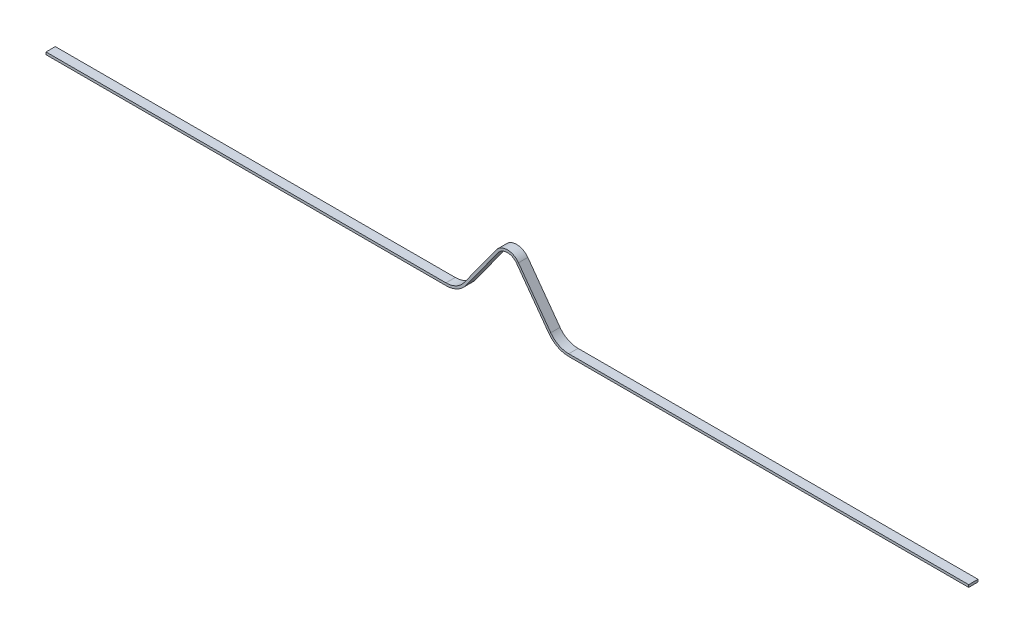
ISO-10303-21;
HEADER;
FILE_DESCRIPTION(('STEP AP214'),'2;1');
FILE_NAME('part.step','',(''),(''),'','','');
FILE_SCHEMA(('AUTOMOTIVE_DESIGN { 1 0 10303 214 1 1 1 1 }'));
ENDSEC;
DATA;
#1=APPLICATION_CONTEXT('core data for automotive mechanical design processes');
#2=APPLICATION_PROTOCOL_DEFINITION('international standard','automotive_design',2000,#1);
#3=PRODUCT_CONTEXT('',#1,'mechanical');
#4=PRODUCT('Part','Part','',(#3));
#5=PRODUCT_RELATED_PRODUCT_CATEGORY('part','',(#4));
#6=PRODUCT_DEFINITION_FORMATION('','',#4);
#7=PRODUCT_DEFINITION_CONTEXT('part definition',#1,'design');
#8=PRODUCT_DEFINITION('design','',#6,#7);
#9=PRODUCT_DEFINITION_SHAPE('','',#8);
#10=(LENGTH_UNIT() NAMED_UNIT(*) SI_UNIT(.MILLI.,.METRE.));
#11=(NAMED_UNIT(*) PLANE_ANGLE_UNIT() SI_UNIT($,.RADIAN.));
#12=(NAMED_UNIT(*) SI_UNIT($,.STERADIAN.) SOLID_ANGLE_UNIT());
#13=UNCERTAINTY_MEASURE_WITH_UNIT(LENGTH_MEASURE(1.E-05),#10,'distance_accuracy_value','');
#14=(GEOMETRIC_REPRESENTATION_CONTEXT(3) GLOBAL_UNCERTAINTY_ASSIGNED_CONTEXT((#13)) GLOBAL_UNIT_ASSIGNED_CONTEXT((#10,
#11,#12)) REPRESENTATION_CONTEXT('',''));
#15=CARTESIAN_POINT('',(0.,0.,0.));
#16=DIRECTION('',(0.,0.,1.));
#17=DIRECTION('',(1.,0.,0.));
#18=AXIS2_PLACEMENT_3D('',#15,#16,#17);
#19=CARTESIAN_POINT('',(248.,-25.7999999999999,2.5));
#20=DIRECTION('',(0.,1.,0.));
#21=DIRECTION('',(-1.,0.,0.));
#22=AXIS2_PLACEMENT_3D('',#19,#20,#21);
#23=PLANE('',#22);
#24=DIRECTION('',(1.,0.,0.));
#25=VECTOR('',#24,1.);
#26=CARTESIAN_POINT('',(248.,-25.7999999999999,-2.5));
#27=LINE('',#26,#25);
#28=CARTESIAN_POINT('',(33.,-25.8,-2.5));
#29=VERTEX_POINT('',#28);
#30=CARTESIAN_POINT('',(248.,-25.7999999999999,-2.5));
#31=VERTEX_POINT('',#30);
#32=EDGE_CURVE('E175',#29,#31,#27,.T.);
#33=ORIENTED_EDGE('',*,*,#32,.T.);
#34=DIRECTION('',(0.,0.,-1.));
#35=VECTOR('',#34,1.);
#36=CARTESIAN_POINT('',(248.,-25.7999999999999,2.5));
#37=LINE('',#36,#35);
#38=CARTESIAN_POINT('',(248.,-25.7999999999999,2.5));
#39=VERTEX_POINT('',#38);
#40=EDGE_CURVE('E11',#39,#31,#37,.T.);
#41=ORIENTED_EDGE('',*,*,#40,.F.);
#42=DIRECTION('',(1.,0.,0.));
#43=VECTOR('',#42,1.);
#44=CARTESIAN_POINT('',(248.,-25.7999999999999,2.5));
#45=LINE('',#44,#43);
#46=CARTESIAN_POINT('',(33.,-25.8,2.5));
#47=VERTEX_POINT('',#46);
#48=EDGE_CURVE('E112',#47,#39,#45,.T.);
#49=ORIENTED_EDGE('',*,*,#48,.F.);
#50=DIRECTION('',(0.,0.,-1.));
#51=VECTOR('',#50,1.);
#52=CARTESIAN_POINT('',(33.,-25.8,2.5));
#53=LINE('',#52,#51);
#54=EDGE_CURVE('E171',#47,#29,#53,.T.);
#55=ORIENTED_EDGE('',*,*,#54,.T.);
#56=EDGE_LOOP('',(#33,#41,#49,#55));
#57=FACE_BOUND('',#56,.T.);
#58=ADVANCED_FACE('F32',(#57),#23,.F.);
#59=CARTESIAN_POINT('',(248.,-24.4999999999999,2.5));
#60=DIRECTION('',(1.,0.,0.));
#61=DIRECTION('',(0.,0.,-1.));
#62=AXIS2_PLACEMENT_3D('',#59,#60,#61);
#63=PLANE('',#62);
#64=DIRECTION('',(0.,-1.,0.));
#65=VECTOR('',#64,1.);
#66=CARTESIAN_POINT('',(248.,-24.4999999999999,-2.5));
#67=LINE('',#66,#65);
#68=CARTESIAN_POINT('',(248.,-24.4999999999999,-2.5));
#69=VERTEX_POINT('',#68);
#70=EDGE_CURVE('E178',#69,#31,#67,.T.);
#71=ORIENTED_EDGE('',*,*,#70,.F.);
#72=DIRECTION('',(0.,0.,-1.));
#73=VECTOR('',#72,1.);
#74=CARTESIAN_POINT('',(248.,-24.4999999999999,2.5));
#75=LINE('',#74,#73);
#76=CARTESIAN_POINT('',(248.,-24.4999999999999,2.5));
#77=VERTEX_POINT('',#76);
#78=EDGE_CURVE('E40',#77,#69,#75,.T.);
#79=ORIENTED_EDGE('',*,*,#78,.F.);
#80=DIRECTION('',(0.,-1.,0.));
#81=VECTOR('',#80,1.);
#82=CARTESIAN_POINT('',(248.,-24.4999999999999,2.5));
#83=LINE('',#82,#81);
#84=EDGE_CURVE('E260',#77,#39,#83,.T.);
#85=ORIENTED_EDGE('',*,*,#84,.T.);
#86=ORIENTED_EDGE('',*,*,#40,.T.);
#87=EDGE_LOOP('',(#71,#79,#85,#86));
#88=FACE_BOUND('',#87,.T.);
#89=ADVANCED_FACE('F247',(#88),#63,.T.);
#90=CARTESIAN_POINT('',(248.,-24.4999999999999,2.5));
#91=DIRECTION('',(0.,1.,0.));
#92=DIRECTION('',(-1.,0.,0.));
#93=AXIS2_PLACEMENT_3D('',#90,#91,#92);
#94=PLANE('',#93);
#95=DIRECTION('',(1.,0.,0.));
#96=VECTOR('',#95,1.);
#97=CARTESIAN_POINT('',(248.,-24.4999999999999,-2.5));
#98=LINE('',#97,#96);
#99=CARTESIAN_POINT('',(33.,-24.5,-2.5));
#100=VERTEX_POINT('',#99);
#101=EDGE_CURVE('E181',#100,#69,#98,.T.);
#102=ORIENTED_EDGE('',*,*,#101,.F.);
#103=DIRECTION('',(0.,0.,-1.));
#104=VECTOR('',#103,1.);
#105=CARTESIAN_POINT('',(33.,-24.5,2.5));
#106=LINE('',#105,#104);
#107=CARTESIAN_POINT('',(33.,-24.5,2.5));
#108=VERTEX_POINT('',#107);
#109=EDGE_CURVE('E237',#108,#100,#106,.T.);
#110=ORIENTED_EDGE('',*,*,#109,.F.);
#111=DIRECTION('',(1.,0.,0.));
#112=VECTOR('',#111,1.);
#113=CARTESIAN_POINT('',(248.,-24.4999999999999,2.5));
#114=LINE('',#113,#112);
#115=EDGE_CURVE('E244',#108,#77,#114,.T.);
#116=ORIENTED_EDGE('',*,*,#115,.T.);
#117=ORIENTED_EDGE('',*,*,#78,.T.);
#118=EDGE_LOOP('',(#102,#110,#116,#117));
#119=FACE_BOUND('',#118,.T.);
#120=ADVANCED_FACE('F242',(#119),#94,.T.);
#121=CARTESIAN_POINT('',(33.,-12.55,2.5));
#122=DIRECTION('',(0.,0.,-1.));
#123=DIRECTION('',(-1.,0.,0.));
#124=AXIS2_PLACEMENT_3D('',#121,#122,#123);
#125=CYLINDRICAL_SURFACE('',#124,11.95);
#126=CARTESIAN_POINT('',(33.,-12.55,-2.5));
#127=DIRECTION('',(0.,0.,1.));
#128=DIRECTION('',(-1.,0.,0.));
#129=AXIS2_PLACEMENT_3D('',#126,#127,#128);
#130=CIRCLE('',#129,11.95);
#131=CARTESIAN_POINT('',(23.3253218533214,-19.5644923378801,-2.5));
#132=VERTEX_POINT('',#131);
#133=EDGE_CURVE('E184',#132,#100,#130,.T.);
#134=ORIENTED_EDGE('',*,*,#133,.F.);
#135=DIRECTION('',(0.,0.,-1.));
#136=VECTOR('',#135,1.);
#137=CARTESIAN_POINT('',(23.3253218533214,-19.5644923378801,2.5));
#138=LINE('',#137,#136);
#139=CARTESIAN_POINT('',(23.3253218533214,-19.5644923378801,2.5));
#140=VERTEX_POINT('',#139);
#141=EDGE_CURVE('E235',#140,#132,#138,.T.);
#142=ORIENTED_EDGE('',*,*,#141,.F.);
#143=CARTESIAN_POINT('',(33.,-12.55,2.5));
#144=DIRECTION('',(0.,0.,1.));
#145=DIRECTION('',(-1.,0.,0.));
#146=AXIS2_PLACEMENT_3D('',#143,#144,#145);
#147=CIRCLE('',#146,11.95);
#148=EDGE_CURVE('E257',#140,#108,#147,.T.);
#149=ORIENTED_EDGE('',*,*,#148,.T.);
#150=ORIENTED_EDGE('',*,*,#109,.T.);
#151=EDGE_LOOP('',(#134,#142,#149,#150));
#152=FACE_BOUND('',#151,.T.);
#153=ADVANCED_FACE('F254',(#152),#125,.F.);
#154=CARTESIAN_POINT('',(23.3253218533214,-19.5644923378801,2.5));
#155=DIRECTION('',(0.809596497630012,0.586986806517164,0.));
#156=DIRECTION('',(-0.586986806517164,0.809596497630012,0.));
#157=AXIS2_PLACEMENT_3D('',#154,#155,#156);
#158=PLANE('',#157);
#159=DIRECTION('',(0.586986806517164,-0.809596497630012,0.));
#160=VECTOR('',#159,1.);
#161=CARTESIAN_POINT('',(23.3253218533214,-19.5644923378801,-2.5));
#162=LINE('',#161,#160);
#163=CARTESIAN_POINT('',(5.99101408246208,4.34370236822701,-2.5));
#164=VERTEX_POINT('',#163);
#165=EDGE_CURVE('E187',#164,#132,#162,.T.);
#166=ORIENTED_EDGE('',*,*,#165,.F.);
#167=DIRECTION('',(0.,0.,-1.));
#168=VECTOR('',#167,1.);
#169=CARTESIAN_POINT('',(5.99101408246208,4.34370236822701,2.5));
#170=LINE('',#169,#168);
#171=CARTESIAN_POINT('',(5.99101408246208,4.34370236822701,2.5));
#172=VERTEX_POINT('',#171);
#173=EDGE_CURVE('E233',#172,#164,#170,.T.);
#174=ORIENTED_EDGE('',*,*,#173,.F.);
#175=DIRECTION('',(0.586986806517164,-0.809596497630012,0.));
#176=VECTOR('',#175,1.);
#177=CARTESIAN_POINT('',(23.3253218533214,-19.5644923378801,2.5));
#178=LINE('',#177,#176);
#179=EDGE_CURVE('E262',#172,#140,#178,.T.);
#180=ORIENTED_EDGE('',*,*,#179,.T.);
#181=ORIENTED_EDGE('',*,*,#141,.T.);
#182=EDGE_LOOP('',(#166,#174,#180,#181));
#183=FACE_BOUND('',#182,.T.);
#184=ADVANCED_FACE('F319',(#183),#158,.T.);
#185=CARTESIAN_POINT('',(0.,0.,2.5));
#186=DIRECTION('',(0.,0.,-1.));
#187=DIRECTION('',(-1.,0.,0.));
#188=AXIS2_PLACEMENT_3D('',#185,#186,#187);
#189=CYLINDRICAL_SURFACE('',#188,7.4);
#190=CARTESIAN_POINT('',(0.,0.,-2.5));
#191=DIRECTION('',(0.,0.,-1.));
#192=DIRECTION('',(1.,0.,0.));
#193=AXIS2_PLACEMENT_3D('',#190,#191,#192);
#194=CIRCLE('',#193,7.4);
#195=CARTESIAN_POINT('',(-5.99101408246209,4.343702368227,-2.5));
#196=VERTEX_POINT('',#195);
#197=EDGE_CURVE('E190',#196,#164,#194,.T.);
#198=ORIENTED_EDGE('',*,*,#197,.F.);
#199=DIRECTION('',(0.,0.,-1.));
#200=VECTOR('',#199,1.);
#201=CARTESIAN_POINT('',(-5.99101408246209,4.343702368227,2.5));
#202=LINE('',#201,#200);
#203=CARTESIAN_POINT('',(-5.99101408246209,4.343702368227,2.5));
#204=VERTEX_POINT('',#203);
#205=EDGE_CURVE('E231',#204,#196,#202,.T.);
#206=ORIENTED_EDGE('',*,*,#205,.F.);
#207=CARTESIAN_POINT('',(0.,0.,2.5));
#208=DIRECTION('',(0.,0.,-1.));
#209=DIRECTION('',(1.,0.,0.));
#210=AXIS2_PLACEMENT_3D('',#207,#208,#209);
#211=CIRCLE('',#210,7.4);
#212=EDGE_CURVE('E268',#204,#172,#211,.T.);
#213=ORIENTED_EDGE('',*,*,#212,.T.);
#214=ORIENTED_EDGE('',*,*,#173,.T.);
#215=EDGE_LOOP('',(#198,#206,#213,#214));
#216=FACE_BOUND('',#215,.T.);
#217=ADVANCED_FACE('F322',(#216),#189,.T.);
#218=CARTESIAN_POINT('',(-23.3253218533214,-19.5644923378801,2.5));
#219=DIRECTION('',(-0.809596497630012,0.586986806517164,0.));
#220=DIRECTION('',(-0.586986806517164,-0.809596497630012,0.));
#221=AXIS2_PLACEMENT_3D('',#218,#219,#220);
#222=PLANE('',#221);
#223=DIRECTION('',(0.586986806517164,0.809596497630012,0.));
#224=VECTOR('',#223,1.);
#225=CARTESIAN_POINT('',(-23.3253218533214,-19.5644923378801,-2.5));
#226=LINE('',#225,#224);
#227=CARTESIAN_POINT('',(-23.3253218533214,-19.5644923378801,-2.5));
#228=VERTEX_POINT('',#227);
#229=EDGE_CURVE('E193',#228,#196,#226,.T.);
#230=ORIENTED_EDGE('',*,*,#229,.F.);
#231=DIRECTION('',(0.,0.,-1.));
#232=VECTOR('',#231,1.);
#233=CARTESIAN_POINT('',(-23.3253218533214,-19.5644923378801,2.5));
#234=LINE('',#233,#232);
#235=CARTESIAN_POINT('',(-23.3253218533214,-19.5644923378801,2.5));
#236=VERTEX_POINT('',#235);
#237=EDGE_CURVE('E229',#236,#228,#234,.T.);
#238=ORIENTED_EDGE('',*,*,#237,.F.);
#239=DIRECTION('',(0.586986806517164,0.809596497630012,0.));
#240=VECTOR('',#239,1.);
#241=CARTESIAN_POINT('',(-23.3253218533214,-19.5644923378801,2.5));
#242=LINE('',#241,#240);
#243=EDGE_CURVE('E271',#236,#204,#242,.T.);
#244=ORIENTED_EDGE('',*,*,#243,.T.);
#245=ORIENTED_EDGE('',*,*,#205,.T.);
#246=EDGE_LOOP('',(#230,#238,#244,#245));
#247=FACE_BOUND('',#246,.T.);
#248=ADVANCED_FACE('F326',(#247),#222,.T.);
#249=CARTESIAN_POINT('',(-33.,-12.55,2.5));
#250=DIRECTION('',(0.,0.,-1.));
#251=DIRECTION('',(-1.,0.,0.));
#252=AXIS2_PLACEMENT_3D('',#249,#250,#251);
#253=CYLINDRICAL_SURFACE('',#252,11.95);
#254=CARTESIAN_POINT('',(-33.,-12.55,-2.5));
#255=DIRECTION('',(0.,0.,1.));
#256=DIRECTION('',(1.,0.,0.));
#257=AXIS2_PLACEMENT_3D('',#254,#255,#256);
#258=CIRCLE('',#257,11.95);
#259=CARTESIAN_POINT('',(-33.,-24.5,-2.5));
#260=VERTEX_POINT('',#259);
#261=EDGE_CURVE('E196',#260,#228,#258,.T.);
#262=ORIENTED_EDGE('',*,*,#261,.F.);
#263=DIRECTION('',(0.,0.,-1.));
#264=VECTOR('',#263,1.);
#265=CARTESIAN_POINT('',(-33.,-24.5,2.5));
#266=LINE('',#265,#264);
#267=CARTESIAN_POINT('',(-33.,-24.5,2.5));
#268=VERTEX_POINT('',#267);
#269=EDGE_CURVE('E227',#268,#260,#266,.T.);
#270=ORIENTED_EDGE('',*,*,#269,.F.);
#271=CARTESIAN_POINT('',(-33.,-12.55,2.5));
#272=DIRECTION('',(0.,0.,1.));
#273=DIRECTION('',(1.,0.,0.));
#274=AXIS2_PLACEMENT_3D('',#271,#272,#273);
#275=CIRCLE('',#274,11.95);
#276=EDGE_CURVE('E274',#268,#236,#275,.T.);
#277=ORIENTED_EDGE('',*,*,#276,.T.);
#278=ORIENTED_EDGE('',*,*,#237,.T.);
#279=EDGE_LOOP('',(#262,#270,#277,#278));
#280=FACE_BOUND('',#279,.T.);
#281=ADVANCED_FACE('F330',(#280),#253,.F.);
#282=CARTESIAN_POINT('',(-248.,-24.5,2.5));
#283=DIRECTION('',(0.,1.,0.));
#284=DIRECTION('',(-1.,0.,0.));
#285=AXIS2_PLACEMENT_3D('',#282,#283,#284);
#286=PLANE('',#285);
#287=DIRECTION('',(1.,0.,0.));
#288=VECTOR('',#287,1.);
#289=CARTESIAN_POINT('',(-248.,-24.5,-2.5));
#290=LINE('',#289,#288);
#291=CARTESIAN_POINT('',(-248.,-24.5,-2.5));
#292=VERTEX_POINT('',#291);
#293=EDGE_CURVE('E199',#292,#260,#290,.T.);
#294=ORIENTED_EDGE('',*,*,#293,.F.);
#295=DIRECTION('',(0.,0.,-1.));
#296=VECTOR('',#295,1.);
#297=CARTESIAN_POINT('',(-248.,-24.5,2.5));
#298=LINE('',#297,#296);
#299=CARTESIAN_POINT('',(-248.,-24.5,2.5));
#300=VERTEX_POINT('',#299);
#301=EDGE_CURVE('E225',#300,#292,#298,.T.);
#302=ORIENTED_EDGE('',*,*,#301,.F.);
#303=DIRECTION('',(1.,0.,0.));
#304=VECTOR('',#303,1.);
#305=CARTESIAN_POINT('',(-248.,-24.5,2.5));
#306=LINE('',#305,#304);
#307=EDGE_CURVE('E277',#300,#268,#306,.T.);
#308=ORIENTED_EDGE('',*,*,#307,.T.);
#309=ORIENTED_EDGE('',*,*,#269,.T.);
#310=EDGE_LOOP('',(#294,#302,#308,#309));
#311=FACE_BOUND('',#310,.T.);
#312=ADVANCED_FACE('F334',(#311),#286,.T.);
#313=CARTESIAN_POINT('',(-248.,-25.8,2.5));
#314=DIRECTION('',(-1.,0.,0.));
#315=DIRECTION('',(0.,0.,1.));
#316=AXIS2_PLACEMENT_3D('',#313,#314,#315);
#317=PLANE('',#316);
#318=DIRECTION('',(0.,1.,0.));
#319=VECTOR('',#318,1.);
#320=CARTESIAN_POINT('',(-248.,-25.8,-2.5));
#321=LINE('',#320,#319);
#322=CARTESIAN_POINT('',(-248.,-25.8,-2.5));
#323=VERTEX_POINT('',#322);
#324=EDGE_CURVE('E202',#323,#292,#321,.T.);
#325=ORIENTED_EDGE('',*,*,#324,.F.);
#326=DIRECTION('',(0.,0.,-1.));
#327=VECTOR('',#326,1.);
#328=CARTESIAN_POINT('',(-248.,-25.8,2.5));
#329=LINE('',#328,#327);
#330=CARTESIAN_POINT('',(-248.,-25.8,2.5));
#331=VERTEX_POINT('',#330);
#332=EDGE_CURVE('E223',#331,#323,#329,.T.);
#333=ORIENTED_EDGE('',*,*,#332,.F.);
#334=DIRECTION('',(0.,1.,0.));
#335=VECTOR('',#334,1.);
#336=CARTESIAN_POINT('',(-248.,-25.8,2.5));
#337=LINE('',#336,#335);
#338=EDGE_CURVE('E280',#331,#300,#337,.T.);
#339=ORIENTED_EDGE('',*,*,#338,.T.);
#340=ORIENTED_EDGE('',*,*,#301,.T.);
#341=EDGE_LOOP('',(#325,#333,#339,#340));
#342=FACE_BOUND('',#341,.T.);
#343=ADVANCED_FACE('F338',(#342),#317,.T.);
#344=CARTESIAN_POINT('',(-248.,-25.8,2.5));
#345=DIRECTION('',(0.,1.,0.));
#346=DIRECTION('',(-1.,0.,0.));
#347=AXIS2_PLACEMENT_3D('',#344,#345,#346);
#348=PLANE('',#347);
#349=DIRECTION('',(1.,0.,0.));
#350=VECTOR('',#349,1.);
#351=CARTESIAN_POINT('',(-248.,-25.8,-2.5));
#352=LINE('',#351,#350);
#353=CARTESIAN_POINT('',(-33.,-25.8,-2.5));
#354=VERTEX_POINT('',#353);
#355=EDGE_CURVE('E205',#323,#354,#352,.T.);
#356=ORIENTED_EDGE('',*,*,#355,.T.);
#357=DIRECTION('',(0.,0.,-1.));
#358=VECTOR('',#357,1.);
#359=CARTESIAN_POINT('',(-33.,-25.8,2.5));
#360=LINE('',#359,#358);
#361=CARTESIAN_POINT('',(-33.,-25.8,2.5));
#362=VERTEX_POINT('',#361);
#363=EDGE_CURVE('E220',#362,#354,#360,.T.);
#364=ORIENTED_EDGE('',*,*,#363,.F.);
#365=DIRECTION('',(1.,0.,0.));
#366=VECTOR('',#365,1.);
#367=CARTESIAN_POINT('',(-248.,-25.8,2.5));
#368=LINE('',#367,#366);
#369=EDGE_CURVE('E283',#331,#362,#368,.T.);
#370=ORIENTED_EDGE('',*,*,#369,.F.);
#371=ORIENTED_EDGE('',*,*,#332,.T.);
#372=EDGE_LOOP('',(#356,#364,#370,#371));
#373=FACE_BOUND('',#372,.T.);
#374=ADVANCED_FACE('F342',(#373),#348,.F.);
#375=CARTESIAN_POINT('',(-33.,-12.55,2.5));
#376=DIRECTION('',(0.,0.,-1.));
#377=DIRECTION('',(-1.,0.,0.));
#378=AXIS2_PLACEMENT_3D('',#375,#376,#377);
#379=CYLINDRICAL_SURFACE('',#378,13.25);
#380=CARTESIAN_POINT('',(-33.,-12.55,-2.5));
#381=DIRECTION('',(0.,0.,1.));
#382=DIRECTION('',(1.,0.,0.));
#383=AXIS2_PLACEMENT_3D('',#380,#381,#382);
#384=CIRCLE('',#383,13.25);
#385=CARTESIAN_POINT('',(-22.2728464064023,-20.3275751863524,-2.5));
#386=VERTEX_POINT('',#385);
#387=EDGE_CURVE('E207',#354,#386,#384,.T.);
#388=ORIENTED_EDGE('',*,*,#387,.T.);
#389=DIRECTION('',(0.,0.,-1.));
#390=VECTOR('',#389,1.);
#391=CARTESIAN_POINT('',(-22.2728464064023,-20.3275751863524,2.5));
#392=LINE('',#391,#390);
#393=CARTESIAN_POINT('',(-22.2728464064023,-20.3275751863524,2.5));
#394=VERTEX_POINT('',#393);
#395=EDGE_CURVE('E217',#394,#386,#392,.T.);
#396=ORIENTED_EDGE('',*,*,#395,.F.);
#397=CARTESIAN_POINT('',(-33.,-12.55,2.5));
#398=DIRECTION('',(0.,0.,1.));
#399=DIRECTION('',(1.,0.,0.));
#400=AXIS2_PLACEMENT_3D('',#397,#398,#399);
#401=CIRCLE('',#400,13.25);
#402=EDGE_CURVE('E285',#362,#394,#401,.T.);
#403=ORIENTED_EDGE('',*,*,#402,.F.);
#404=ORIENTED_EDGE('',*,*,#363,.T.);
#405=EDGE_LOOP('',(#388,#396,#403,#404));
#406=FACE_BOUND('',#405,.T.);
#407=ADVANCED_FACE('F292',(#406),#379,.T.);
#408=CARTESIAN_POINT('',(-22.2728464064023,-20.3275751863524,2.5));
#409=DIRECTION('',(-0.809596497630012,0.586986806517164,0.));
#410=DIRECTION('',(-0.586986806517164,-0.809596497630012,0.));
#411=AXIS2_PLACEMENT_3D('',#408,#409,#410);
#412=PLANE('',#411);
#413=DIRECTION('',(0.586986806517164,0.809596497630012,0.));
#414=VECTOR('',#413,1.);
#415=CARTESIAN_POINT('',(-22.2728464064023,-20.3275751863524,-2.5));
#416=LINE('',#415,#414);
#417=CARTESIAN_POINT('',(-4.93853863554307,3.58061951975469,-2.5));
#418=VERTEX_POINT('',#417);
#419=EDGE_CURVE('E209',#386,#418,#416,.T.);
#420=ORIENTED_EDGE('',*,*,#419,.T.);
#421=DIRECTION('',(0.,0.,-1.));
#422=VECTOR('',#421,1.);
#423=CARTESIAN_POINT('',(-4.93853863554307,3.58061951975469,2.5));
#424=LINE('',#423,#422);
#425=CARTESIAN_POINT('',(-4.93853863554307,3.58061951975469,2.5));
#426=VERTEX_POINT('',#425);
#427=EDGE_CURVE('E166',#426,#418,#424,.T.);
#428=ORIENTED_EDGE('',*,*,#427,.F.);
#429=DIRECTION('',(0.586986806517164,0.809596497630012,0.));
#430=VECTOR('',#429,1.);
#431=CARTESIAN_POINT('',(-22.2728464064023,-20.3275751863524,2.5));
#432=LINE('',#431,#430);
#433=EDGE_CURVE('E157',#394,#426,#432,.T.);
#434=ORIENTED_EDGE('',*,*,#433,.F.);
#435=ORIENTED_EDGE('',*,*,#395,.T.);
#436=EDGE_LOOP('',(#420,#428,#434,#435));
#437=FACE_BOUND('',#436,.T.);
#438=ADVANCED_FACE('F296',(#437),#412,.F.);
#439=CARTESIAN_POINT('',(0.,0.,2.5));
#440=DIRECTION('',(0.,0.,-1.));
#441=DIRECTION('',(-1.,0.,0.));
#442=AXIS2_PLACEMENT_3D('',#439,#440,#441);
#443=CYLINDRICAL_SURFACE('',#442,6.1);
#444=CARTESIAN_POINT('',(0.,0.,-2.5));
#445=DIRECTION('',(0.,0.,1.));
#446=DIRECTION('',(1.,0.,0.));
#447=AXIS2_PLACEMENT_3D('',#444,#445,#446);
#448=CIRCLE('',#447,6.1);
#449=CARTESIAN_POINT('',(4.93853863554307,3.5806195197547,-2.5));
#450=VERTEX_POINT('',#449);
#451=EDGE_CURVE('E165',#418,#450,#448,.F.);
#452=ORIENTED_EDGE('',*,*,#451,.T.);
#453=DIRECTION('',(0.,0.,-1.));
#454=VECTOR('',#453,1.);
#455=CARTESIAN_POINT('',(4.93853863554307,3.5806195197547,2.5));
#456=LINE('',#455,#454);
#457=CARTESIAN_POINT('',(4.93853863554307,3.5806195197547,2.5));
#458=VERTEX_POINT('',#457);
#459=EDGE_CURVE('E162',#458,#450,#456,.T.);
#460=ORIENTED_EDGE('',*,*,#459,.F.);
#461=CARTESIAN_POINT('',(0.,0.,2.5));
#462=DIRECTION('',(0.,0.,1.));
#463=DIRECTION('',(1.,0.,0.));
#464=AXIS2_PLACEMENT_3D('',#461,#462,#463);
#465=CIRCLE('',#464,6.1);
#466=EDGE_CURVE('E151',#426,#458,#465,.F.);
#467=ORIENTED_EDGE('',*,*,#466,.F.);
#468=ORIENTED_EDGE('',*,*,#427,.T.);
#469=EDGE_LOOP('',(#452,#460,#467,#468));
#470=FACE_BOUND('',#469,.T.);
#471=ADVANCED_FACE('F163',(#470),#443,.F.);
#472=CARTESIAN_POINT('',(22.2728464064023,-20.3275751863524,2.5));
#473=DIRECTION('',(0.809596497630012,0.586986806517164,0.));
#474=DIRECTION('',(-0.586986806517164,0.809596497630012,0.));
#475=AXIS2_PLACEMENT_3D('',#472,#473,#474);
#476=PLANE('',#475);
#477=DIRECTION('',(0.586986806517164,-0.809596497630012,0.));
#478=VECTOR('',#477,1.);
#479=CARTESIAN_POINT('',(22.2728464064023,-20.3275751863524,-2.5));
#480=LINE('',#479,#478);
#481=CARTESIAN_POINT('',(22.2728464064023,-20.3275751863524,-2.5));
#482=VERTEX_POINT('',#481);
#483=EDGE_CURVE('E100',#450,#482,#480,.T.);
#484=ORIENTED_EDGE('',*,*,#483,.T.);
#485=DIRECTION('',(0.,0.,-1.));
#486=VECTOR('',#485,1.);
#487=CARTESIAN_POINT('',(22.2728464064023,-20.3275751863524,2.5));
#488=LINE('',#487,#486);
#489=CARTESIAN_POINT('',(22.2728464064023,-20.3275751863524,2.5));
#490=VERTEX_POINT('',#489);
#491=EDGE_CURVE('E167',#490,#482,#488,.T.);
#492=ORIENTED_EDGE('',*,*,#491,.F.);
#493=DIRECTION('',(0.586986806517164,-0.809596497630012,0.));
#494=VECTOR('',#493,1.);
#495=CARTESIAN_POINT('',(22.2728464064023,-20.3275751863524,2.5));
#496=LINE('',#495,#494);
#497=EDGE_CURVE('E155',#458,#490,#496,.T.);
#498=ORIENTED_EDGE('',*,*,#497,.F.);
#499=ORIENTED_EDGE('',*,*,#459,.T.);
#500=EDGE_LOOP('',(#484,#492,#498,#499));
#501=FACE_BOUND('',#500,.T.);
#502=ADVANCED_FACE('F169',(#501),#476,.F.);
#503=CARTESIAN_POINT('',(33.,-12.55,2.5));
#504=DIRECTION('',(0.,0.,-1.));
#505=DIRECTION('',(-1.,0.,0.));
#506=AXIS2_PLACEMENT_3D('',#503,#504,#505);
#507=CYLINDRICAL_SURFACE('',#506,13.25);
#508=CARTESIAN_POINT('',(33.,-12.55,-2.5));
#509=DIRECTION('',(0.,0.,1.));
#510=DIRECTION('',(1.,0.,0.));
#511=AXIS2_PLACEMENT_3D('',#508,#509,#510);
#512=CIRCLE('',#511,13.25);
#513=EDGE_CURVE('E106',#482,#29,#512,.T.);
#514=ORIENTED_EDGE('',*,*,#513,.T.);
#515=ORIENTED_EDGE('',*,*,#54,.F.);
#516=CARTESIAN_POINT('',(33.,-12.55,2.5));
#517=DIRECTION('',(0.,0.,1.));
#518=DIRECTION('',(1.,0.,0.));
#519=AXIS2_PLACEMENT_3D('',#516,#517,#518);
#520=CIRCLE('',#519,13.25);
#521=EDGE_CURVE('E48',#490,#47,#520,.T.);
#522=ORIENTED_EDGE('',*,*,#521,.F.);
#523=ORIENTED_EDGE('',*,*,#491,.T.);
#524=EDGE_LOOP('',(#514,#515,#522,#523));
#525=FACE_BOUND('',#524,.T.);
#526=ADVANCED_FACE('F298',(#525),#507,.T.);
#527=CARTESIAN_POINT('',(33.,-12.55,2.5));
#528=DIRECTION('',(0.,0.,1.));
#529=DIRECTION('',(1.,0.,0.));
#530=AXIS2_PLACEMENT_3D('',#527,#528,#529);
#531=PLANE('',#530);
#532=ORIENTED_EDGE('',*,*,#48,.T.);
#533=ORIENTED_EDGE('',*,*,#84,.F.);
#534=ORIENTED_EDGE('',*,*,#115,.F.);
#535=ORIENTED_EDGE('',*,*,#148,.F.);
#536=ORIENTED_EDGE('',*,*,#179,.F.);
#537=ORIENTED_EDGE('',*,*,#212,.F.);
#538=ORIENTED_EDGE('',*,*,#243,.F.);
#539=ORIENTED_EDGE('',*,*,#276,.F.);
#540=ORIENTED_EDGE('',*,*,#307,.F.);
#541=ORIENTED_EDGE('',*,*,#338,.F.);
#542=ORIENTED_EDGE('',*,*,#369,.T.);
#543=ORIENTED_EDGE('',*,*,#402,.T.);
#544=ORIENTED_EDGE('',*,*,#433,.T.);
#545=ORIENTED_EDGE('',*,*,#466,.T.);
#546=ORIENTED_EDGE('',*,*,#497,.T.);
#547=ORIENTED_EDGE('',*,*,#521,.T.);
#548=EDGE_LOOP('',(#532,#533,#534,#535,#536,#537,#538,#539,#540,#541,#542,#543,#544,#545,#546,#547));
#549=FACE_BOUND('',#548,.T.);
#550=ADVANCED_FACE('F153',(#549),#531,.T.);
#551=CARTESIAN_POINT('',(33.,-12.55,-2.5));
#552=DIRECTION('',(0.,0.,1.));
#553=DIRECTION('',(1.,0.,0.));
#554=AXIS2_PLACEMENT_3D('',#551,#552,#553);
#555=PLANE('',#554);
#556=ORIENTED_EDGE('',*,*,#32,.F.);
#557=ORIENTED_EDGE('',*,*,#513,.F.);
#558=ORIENTED_EDGE('',*,*,#483,.F.);
#559=ORIENTED_EDGE('',*,*,#451,.F.);
#560=ORIENTED_EDGE('',*,*,#419,.F.);
#561=ORIENTED_EDGE('',*,*,#387,.F.);
#562=ORIENTED_EDGE('',*,*,#355,.F.);
#563=ORIENTED_EDGE('',*,*,#324,.T.);
#564=ORIENTED_EDGE('',*,*,#293,.T.);
#565=ORIENTED_EDGE('',*,*,#261,.T.);
#566=ORIENTED_EDGE('',*,*,#229,.T.);
#567=ORIENTED_EDGE('',*,*,#197,.T.);
#568=ORIENTED_EDGE('',*,*,#165,.T.);
#569=ORIENTED_EDGE('',*,*,#133,.T.);
#570=ORIENTED_EDGE('',*,*,#101,.T.);
#571=ORIENTED_EDGE('',*,*,#70,.T.);
#572=EDGE_LOOP('',(#556,#557,#558,#559,#560,#561,#562,#563,#564,#565,#566,#567,#568,#569,#570,#571));
#573=FACE_BOUND('',#572,.T.);
#574=ADVANCED_FACE('F250',(#573),#555,.F.);
#575=CLOSED_SHELL('',(#58,#89,#120,#153,#184,#217,#248,#281,#312,#343,#374,#407,#438,#471,#502,
#526,#550,#574));
#576=MANIFOLD_SOLID_BREP('B2',#575);
#577=ADVANCED_BREP_SHAPE_REPRESENTATION('',(#18,#576),#14);
#578=SHAPE_DEFINITION_REPRESENTATION(#9,#577);
ENDSEC;
END-ISO-10303-21;
